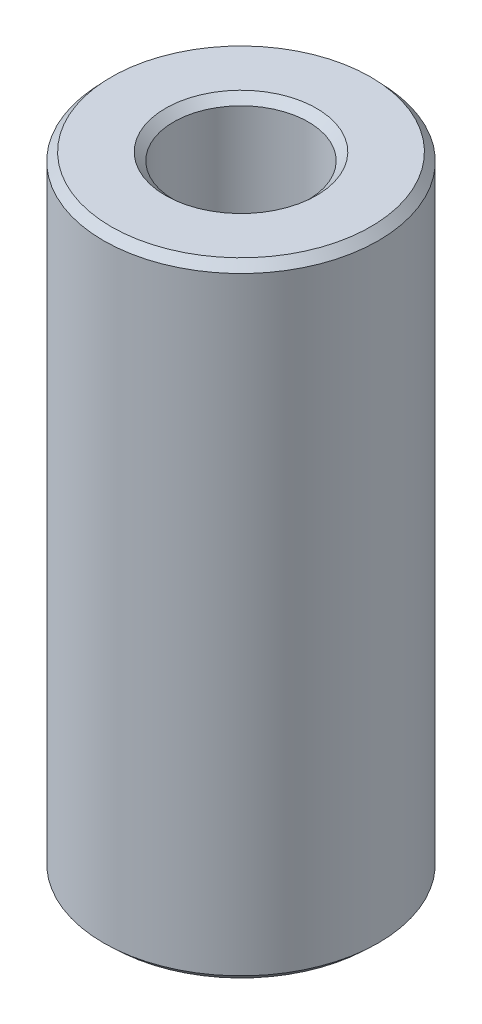
ISO-10303-21;
HEADER;
FILE_DESCRIPTION(('STEP AP214'),'2;1');
FILE_NAME('part.step','',(''),(''),'','','');
FILE_SCHEMA(('AUTOMOTIVE_DESIGN { 1 0 10303 214 1 1 1 1 }'));
ENDSEC;
DATA;
#1=APPLICATION_CONTEXT('core data for automotive mechanical design processes');
#2=APPLICATION_PROTOCOL_DEFINITION('international standard','automotive_design',2000,#1);
#3=PRODUCT_CONTEXT('',#1,'mechanical');
#4=PRODUCT('Part','Part','',(#3));
#5=PRODUCT_RELATED_PRODUCT_CATEGORY('part','',(#4));
#6=PRODUCT_DEFINITION_FORMATION('','',#4);
#7=PRODUCT_DEFINITION_CONTEXT('part definition',#1,'design');
#8=PRODUCT_DEFINITION('design','',#6,#7);
#9=PRODUCT_DEFINITION_SHAPE('','',#8);
#10=(LENGTH_UNIT() NAMED_UNIT(*) SI_UNIT(.MILLI.,.METRE.));
#11=(NAMED_UNIT(*) PLANE_ANGLE_UNIT() SI_UNIT($,.RADIAN.));
#12=(NAMED_UNIT(*) SI_UNIT($,.STERADIAN.) SOLID_ANGLE_UNIT());
#13=UNCERTAINTY_MEASURE_WITH_UNIT(LENGTH_MEASURE(1.E-05),#10,'distance_accuracy_value','');
#14=(GEOMETRIC_REPRESENTATION_CONTEXT(3) GLOBAL_UNCERTAINTY_ASSIGNED_CONTEXT((#13)) GLOBAL_UNIT_ASSIGNED_CONTEXT((#10,
#11,#12)) REPRESENTATION_CONTEXT('',''));
#15=CARTESIAN_POINT('',(0.,0.,0.));
#16=DIRECTION('',(0.,0.,1.));
#17=DIRECTION('',(1.,0.,0.));
#18=AXIS2_PLACEMENT_3D('',#15,#16,#17);
#19=CARTESIAN_POINT('',(0.,102.198678211222,0.));
#20=DIRECTION('',(0.,-1.,0.));
#21=DIRECTION('',(0.,0.,-1.));
#22=AXIS2_PLACEMENT_3D('',#19,#20,#21);
#23=CYLINDRICAL_SURFACE('',#22,22.5);
#24=CARTESIAN_POINT('',(0.,1.25821860521536,0.));
#25=DIRECTION('',(0.,1.,0.));
#26=DIRECTION('',(0.,0.,1.));
#27=AXIS2_PLACEMENT_3D('',#24,#25,#26);
#28=CIRCLE('',#27,22.5);
#29=CARTESIAN_POINT('',(0.,1.25821860521536,22.5));
#30=VERTEX_POINT('',#29);
#31=EDGE_CURVE('E10',#30,#30,#28,.T.);
#32=ORIENTED_EDGE('',*,*,#31,.T.);
#33=EDGE_LOOP('',(#32));
#34=FACE_BOUND('',#33,.T.);
#35=CARTESIAN_POINT('',(0.,100.854467253868,0.));
#36=DIRECTION('',(0.,1.,0.));
#37=DIRECTION('',(0.,0.,1.));
#38=AXIS2_PLACEMENT_3D('',#35,#36,#37);
#39=CIRCLE('',#38,22.5);
#40=CARTESIAN_POINT('',(0.,100.854467253868,22.5));
#41=VERTEX_POINT('',#40);
#42=EDGE_CURVE('E50',#41,#41,#39,.F.);
#43=ORIENTED_EDGE('',*,*,#42,.T.);
#44=EDGE_LOOP('',(#43));
#45=FACE_BOUND('',#44,.T.);
#46=ADVANCED_FACE('F39',(#34,#45),#23,.T.);
#47=CARTESIAN_POINT('',(0.,102.198678211222,0.));
#48=DIRECTION('',(0.,1.,0.));
#49=DIRECTION('',(0.,0.,1.));
#50=AXIS2_PLACEMENT_3D('',#47,#48,#49);
#51=PLANE('',#50);
#52=CARTESIAN_POINT('',(0.,102.198678211222,0.));
#53=DIRECTION('',(0.,1.,0.));
#54=DIRECTION('',(0.,0.,1.));
#55=AXIS2_PLACEMENT_3D('',#52,#53,#54);
#56=CIRCLE('',#55,12.3705231296304);
#57=CARTESIAN_POINT('',(0.,102.198678211222,12.3705231296304));
#58=VERTEX_POINT('',#57);
#59=EDGE_CURVE('E58',#58,#58,#56,.F.);
#60=ORIENTED_EDGE('',*,*,#59,.T.);
#61=EDGE_LOOP('',(#60));
#62=FACE_BOUND('',#61,.T.);
#63=CARTESIAN_POINT('',(0.,102.198678211222,0.));
#64=DIRECTION('',(0.,1.,0.));
#65=DIRECTION('',(0.,0.,1.));
#66=AXIS2_PLACEMENT_3D('',#63,#64,#65);
#67=CIRCLE('',#66,21.2417813947846);
#68=CARTESIAN_POINT('',(0.,102.198678211222,21.2417813947846));
#69=VERTEX_POINT('',#68);
#70=EDGE_CURVE('E61',#69,#69,#67,.T.);
#71=ORIENTED_EDGE('',*,*,#70,.T.);
#72=EDGE_LOOP('',(#71));
#73=FACE_BOUND('',#72,.T.);
#74=ADVANCED_FACE('F88',(#62,#73),#51,.T.);
#75=CARTESIAN_POINT('',(0.,0.,0.));
#76=DIRECTION('',(0.,1.,0.));
#77=DIRECTION('',(0.,0.,1.));
#78=AXIS2_PLACEMENT_3D('',#75,#76,#77);
#79=PLANE('',#78);
#80=CARTESIAN_POINT('',(0.,0.,0.));
#81=DIRECTION('',(0.,1.,0.));
#82=DIRECTION('',(0.,0.,1.));
#83=AXIS2_PLACEMENT_3D('',#80,#81,#82);
#84=CIRCLE('',#83,12.2845307774917);
#85=CARTESIAN_POINT('',(0.,0.,12.2845307774917));
#86=VERTEX_POINT('',#85);
#87=EDGE_CURVE('E51',#86,#86,#84,.T.);
#88=ORIENTED_EDGE('',*,*,#87,.T.);
#89=EDGE_LOOP('',(#88));
#90=FACE_BOUND('',#89,.T.);
#91=CARTESIAN_POINT('',(0.,0.,0.));
#92=DIRECTION('',(0.,1.,0.));
#93=DIRECTION('',(0.,0.,1.));
#94=AXIS2_PLACEMENT_3D('',#91,#92,#93);
#95=CIRCLE('',#94,21.1557890426459);
#96=CARTESIAN_POINT('',(0.,0.,21.1557890426459));
#97=VERTEX_POINT('',#96);
#98=EDGE_CURVE('E54',#97,#97,#95,.F.);
#99=ORIENTED_EDGE('',*,*,#98,.T.);
#100=EDGE_LOOP('',(#99));
#101=FACE_BOUND('',#100,.T.);
#102=ADVANCED_FACE('F83',(#90,#101),#79,.F.);
#103=CARTESIAN_POINT('',(0.,102.198678211222,0.));
#104=DIRECTION('',(0.,-1.,0.));
#105=DIRECTION('',(0.,0.,-1.));
#106=AXIS2_PLACEMENT_3D('',#103,#104,#105);
#107=CYLINDRICAL_SURFACE('',#106,11.0263121722763);
#108=CARTESIAN_POINT('',(0.,100.940459606007,0.));
#109=DIRECTION('',(0.,1.,0.));
#110=DIRECTION('',(0.,0.,1.));
#111=AXIS2_PLACEMENT_3D('',#108,#109,#110);
#112=CIRCLE('',#111,11.0263121722763);
#113=CARTESIAN_POINT('',(0.,100.940459606007,11.0263121722763));
#114=VERTEX_POINT('',#113);
#115=EDGE_CURVE('E67',#114,#114,#112,.T.);
#116=ORIENTED_EDGE('',*,*,#115,.T.);
#117=EDGE_LOOP('',(#116));
#118=FACE_BOUND('',#117,.T.);
#119=CARTESIAN_POINT('',(0.,1.34421095735414,0.));
#120=DIRECTION('',(0.,1.,0.));
#121=DIRECTION('',(0.,0.,1.));
#122=AXIS2_PLACEMENT_3D('',#119,#120,#121);
#123=CIRCLE('',#122,11.0263121722763);
#124=CARTESIAN_POINT('',(0.,1.34421095735414,11.0263121722763));
#125=VERTEX_POINT('',#124);
#126=EDGE_CURVE('E69',#125,#125,#123,.F.);
#127=ORIENTED_EDGE('',*,*,#126,.T.);
#128=EDGE_LOOP('',(#127));
#129=FACE_BOUND('',#128,.T.);
#130=ADVANCED_FACE('F71',(#118,#129),#107,.F.);
#131=CARTESIAN_POINT('',(0.,100.940459606007,0.));
#132=DIRECTION('',(0.,1.,0.));
#133=DIRECTION('',(0.,0.,1.));
#134=AXIS2_PLACEMENT_3D('',#131,#132,#133);
#135=CONICAL_SURFACE('',#134,11.0263121722763,0.818429249824643);
#136=ORIENTED_EDGE('',*,*,#59,.F.);
#137=EDGE_LOOP('',(#136));
#138=FACE_BOUND('',#137,.T.);
#139=ORIENTED_EDGE('',*,*,#115,.F.);
#140=EDGE_LOOP('',(#139));
#141=FACE_BOUND('',#140,.T.);
#142=ADVANCED_FACE('F77',(#138,#141),#135,.F.);
#143=CARTESIAN_POINT('',(0.,0.,0.));
#144=DIRECTION('',(0.,-1.,0.));
#145=DIRECTION('',(0.,0.,-1.));
#146=AXIS2_PLACEMENT_3D('',#143,#144,#145);
#147=CONICAL_SURFACE('',#146,12.2845307774917,0.752367076970255);
#148=ORIENTED_EDGE('',*,*,#126,.F.);
#149=EDGE_LOOP('',(#148));
#150=FACE_BOUND('',#149,.T.);
#151=ORIENTED_EDGE('',*,*,#87,.F.);
#152=EDGE_LOOP('',(#151));
#153=FACE_BOUND('',#152,.T.);
#154=ADVANCED_FACE('F73',(#150,#153),#147,.F.);
#155=CARTESIAN_POINT('',(0.,1.25821860521536,0.));
#156=DIRECTION('',(0.,1.,0.));
#157=DIRECTION('',(0.,0.,1.));
#158=AXIS2_PLACEMENT_3D('',#155,#156,#157);
#159=CONICAL_SURFACE('',#158,22.5,0.81842924982465);
#160=ORIENTED_EDGE('',*,*,#98,.F.);
#161=EDGE_LOOP('',(#160));
#162=FACE_BOUND('',#161,.T.);
#163=ORIENTED_EDGE('',*,*,#31,.F.);
#164=EDGE_LOOP('',(#163));
#165=FACE_BOUND('',#164,.T.);
#166=ADVANCED_FACE('F76',(#162,#165),#159,.T.);
#167=CARTESIAN_POINT('',(0.,102.198678211222,0.));
#168=DIRECTION('',(0.,-1.,0.));
#169=DIRECTION('',(0.,0.,-1.));
#170=AXIS2_PLACEMENT_3D('',#167,#168,#169);
#171=CONICAL_SURFACE('',#170,21.2417813947846,0.752367076970249);
#172=ORIENTED_EDGE('',*,*,#42,.F.);
#173=EDGE_LOOP('',(#172));
#174=FACE_BOUND('',#173,.T.);
#175=ORIENTED_EDGE('',*,*,#70,.F.);
#176=EDGE_LOOP('',(#175));
#177=FACE_BOUND('',#176,.T.);
#178=ADVANCED_FACE('F45',(#174,#177),#171,.T.);
#179=CLOSED_SHELL('',(#46,#74,#102,#130,#142,#154,#166,#178));
#180=MANIFOLD_SOLID_BREP('B2',#179);
#181=ADVANCED_BREP_SHAPE_REPRESENTATION('',(#18,#180),#14);
#182=SHAPE_DEFINITION_REPRESENTATION(#9,#181);
ENDSEC;
END-ISO-10303-21;
